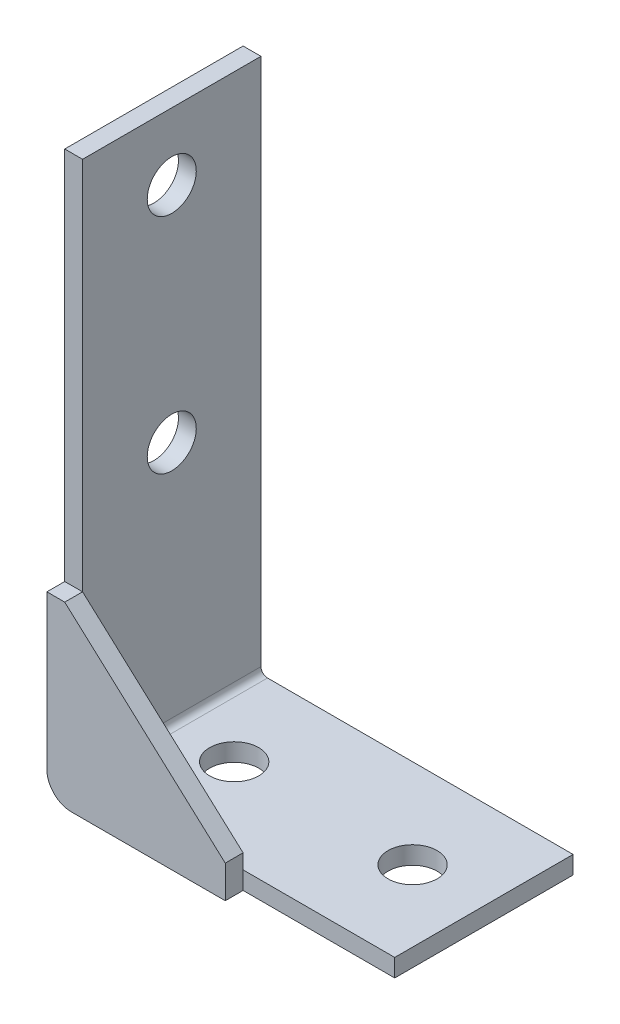
ISO-10303-21;
HEADER;
FILE_DESCRIPTION(('STEP AP214'),'2;1');
FILE_NAME('part.step','',(''),(''),'','','');
FILE_SCHEMA(('AUTOMOTIVE_DESIGN { 1 0 10303 214 1 1 1 1 }'));
ENDSEC;
DATA;
#1=APPLICATION_CONTEXT('core data for automotive mechanical design processes');
#2=APPLICATION_PROTOCOL_DEFINITION('international standard','automotive_design',2000,#1);
#3=PRODUCT_CONTEXT('',#1,'mechanical');
#4=PRODUCT('Part','Part','',(#3));
#5=PRODUCT_RELATED_PRODUCT_CATEGORY('part','',(#4));
#6=PRODUCT_DEFINITION_FORMATION('','',#4);
#7=PRODUCT_DEFINITION_CONTEXT('part definition',#1,'design');
#8=PRODUCT_DEFINITION('design','',#6,#7);
#9=PRODUCT_DEFINITION_SHAPE('','',#8);
#10=(LENGTH_UNIT() NAMED_UNIT(*) SI_UNIT(.MILLI.,.METRE.));
#11=(NAMED_UNIT(*) PLANE_ANGLE_UNIT() SI_UNIT($,.RADIAN.));
#12=(NAMED_UNIT(*) SI_UNIT($,.STERADIAN.) SOLID_ANGLE_UNIT());
#13=UNCERTAINTY_MEASURE_WITH_UNIT(LENGTH_MEASURE(1.E-05),#10,'distance_accuracy_value','');
#14=(GEOMETRIC_REPRESENTATION_CONTEXT(3) GLOBAL_UNCERTAINTY_ASSIGNED_CONTEXT((#13)) GLOBAL_UNIT_ASSIGNED_CONTEXT((#10,
#11,#12)) REPRESENTATION_CONTEXT('',''));
#15=CARTESIAN_POINT('',(0.,0.,0.));
#16=DIRECTION('',(0.,0.,1.));
#17=DIRECTION('',(1.,0.,0.));
#18=AXIS2_PLACEMENT_3D('',#15,#16,#17);
#19=CARTESIAN_POINT('',(0.736599999999993,-2.,12.));
#20=DIRECTION('',(0.,1.,0.));
#21=DIRECTION('',(0.,0.,1.));
#22=AXIS2_PLACEMENT_3D('',#19,#20,#21);
#23=PLANE('',#22);
#24=DIRECTION('',(1.,0.,0.));
#25=VECTOR('',#24,1.);
#26=CARTESIAN_POINT('',(0.736599999999993,-2.,10.));
#27=LINE('',#26,#25);
#28=CARTESIAN_POINT('',(0.736599999999993,-2.,10.));
#29=VERTEX_POINT('',#28);
#30=CARTESIAN_POINT('',(18.,-2.,10.));
#31=VERTEX_POINT('',#30);
#32=EDGE_CURVE('E135',#29,#31,#27,.T.);
#33=ORIENTED_EDGE('',*,*,#32,.T.);
#34=DIRECTION('',(0.,0.,-1.));
#35=VECTOR('',#34,1.);
#36=CARTESIAN_POINT('',(18.,-2.,12.));
#37=LINE('',#36,#35);
#38=CARTESIAN_POINT('',(18.,-2.,12.));
#39=VERTEX_POINT('',#38);
#40=EDGE_CURVE('E12',#39,#31,#37,.T.);
#41=ORIENTED_EDGE('',*,*,#40,.F.);
#42=DIRECTION('',(1.,0.,0.));
#43=VECTOR('',#42,1.);
#44=CARTESIAN_POINT('',(0.736599999999993,-2.,12.));
#45=LINE('',#44,#43);
#46=CARTESIAN_POINT('',(0.736599999999993,-2.,12.));
#47=VERTEX_POINT('',#46);
#48=EDGE_CURVE('E145',#47,#39,#45,.T.);
#49=ORIENTED_EDGE('',*,*,#48,.F.);
#50=DIRECTION('',(0.,0.,-1.));
#51=VECTOR('',#50,1.);
#52=CARTESIAN_POINT('',(0.736599999999993,-2.,12.));
#53=LINE('',#52,#51);
#54=EDGE_CURVE('E131',#47,#29,#53,.T.);
#55=ORIENTED_EDGE('',*,*,#54,.T.);
#56=EDGE_LOOP('',(#33,#41,#49,#55));
#57=FACE_BOUND('',#56,.T.);
#58=ADVANCED_FACE('F51',(#57),#23,.F.);
#59=CARTESIAN_POINT('',(18.,-2.,12.));
#60=DIRECTION('',(-1.,0.,0.));
#61=DIRECTION('',(0.,0.,1.));
#62=AXIS2_PLACEMENT_3D('',#59,#60,#61);
#63=PLANE('',#62);
#64=DIRECTION('',(0.,1.,0.));
#65=VECTOR('',#64,1.);
#66=CARTESIAN_POINT('',(18.,-2.,10.));
#67=LINE('',#66,#65);
#68=CARTESIAN_POINT('',(18.,1.65638944791499,10.));
#69=VERTEX_POINT('',#68);
#70=EDGE_CURVE('E138',#31,#69,#67,.T.);
#71=ORIENTED_EDGE('',*,*,#70,.T.);
#72=DIRECTION('',(0.,0.,-1.));
#73=VECTOR('',#72,1.);
#74=CARTESIAN_POINT('',(18.,1.65638944791499,12.));
#75=LINE('',#74,#73);
#76=CARTESIAN_POINT('',(18.,1.65638944791499,12.));
#77=VERTEX_POINT('',#76);
#78=EDGE_CURVE('E59',#77,#69,#75,.T.);
#79=ORIENTED_EDGE('',*,*,#78,.F.);
#80=DIRECTION('',(0.,1.,0.));
#81=VECTOR('',#80,1.);
#82=CARTESIAN_POINT('',(18.,-2.,12.));
#83=LINE('',#82,#81);
#84=EDGE_CURVE('E104',#39,#77,#83,.T.);
#85=ORIENTED_EDGE('',*,*,#84,.F.);
#86=ORIENTED_EDGE('',*,*,#40,.T.);
#87=EDGE_LOOP('',(#71,#79,#85,#86));
#88=FACE_BOUND('',#87,.T.);
#89=ADVANCED_FACE('F169',(#88),#63,.F.);
#90=CARTESIAN_POINT('',(18.,1.65638944791499,12.));
#91=DIRECTION('',(-0.67222169896844,-0.740349908783667,0.));
#92=DIRECTION('',(0.740349908783667,-0.67222169896844,0.));
#93=AXIS2_PLACEMENT_3D('',#90,#91,#92);
#94=PLANE('',#93);
#95=DIRECTION('',(-0.740349908783667,0.67222169896844,0.));
#96=VECTOR('',#95,1.);
#97=CARTESIAN_POINT('',(18.,1.65638944791499,10.));
#98=LINE('',#97,#96);
#99=CARTESIAN_POINT('',(0.,18.,10.));
#100=VERTEX_POINT('',#99);
#101=EDGE_CURVE('E140',#69,#100,#98,.T.);
#102=ORIENTED_EDGE('',*,*,#101,.T.);
#103=DIRECTION('',(0.,0.,-1.));
#104=VECTOR('',#103,1.);
#105=CARTESIAN_POINT('',(0.,18.,12.));
#106=LINE('',#105,#104);
#107=CARTESIAN_POINT('',(0.,18.,12.));
#108=VERTEX_POINT('',#107);
#109=EDGE_CURVE('E126',#108,#100,#106,.T.);
#110=ORIENTED_EDGE('',*,*,#109,.F.);
#111=DIRECTION('',(-0.740349908783667,0.67222169896844,0.));
#112=VECTOR('',#111,1.);
#113=CARTESIAN_POINT('',(18.,1.65638944791499,12.));
#114=LINE('',#113,#112);
#115=EDGE_CURVE('E117',#77,#108,#114,.T.);
#116=ORIENTED_EDGE('',*,*,#115,.F.);
#117=ORIENTED_EDGE('',*,*,#78,.T.);
#118=EDGE_LOOP('',(#102,#110,#116,#117));
#119=FACE_BOUND('',#118,.T.);
#120=ADVANCED_FACE('F151',(#119),#94,.F.);
#121=CARTESIAN_POINT('',(0.,18.,12.));
#122=DIRECTION('',(0.,-1.,0.));
#123=DIRECTION('',(0.,0.,-1.));
#124=AXIS2_PLACEMENT_3D('',#121,#122,#123);
#125=PLANE('',#124);
#126=DIRECTION('',(-1.,0.,0.));
#127=VECTOR('',#126,1.);
#128=CARTESIAN_POINT('',(0.,18.,10.));
#129=LINE('',#128,#127);
#130=CARTESIAN_POINT('',(-2.,18.,10.));
#131=VERTEX_POINT('',#130);
#132=EDGE_CURVE('E125',#100,#131,#129,.T.);
#133=ORIENTED_EDGE('',*,*,#132,.T.);
#134=DIRECTION('',(0.,0.,-1.));
#135=VECTOR('',#134,1.);
#136=CARTESIAN_POINT('',(-2.,18.,12.));
#137=LINE('',#136,#135);
#138=CARTESIAN_POINT('',(-2.,18.,12.));
#139=VERTEX_POINT('',#138);
#140=EDGE_CURVE('E122',#139,#131,#137,.T.);
#141=ORIENTED_EDGE('',*,*,#140,.F.);
#142=DIRECTION('',(-1.,0.,0.));
#143=VECTOR('',#142,1.);
#144=CARTESIAN_POINT('',(0.,18.,12.));
#145=LINE('',#144,#143);
#146=EDGE_CURVE('E111',#108,#139,#145,.T.);
#147=ORIENTED_EDGE('',*,*,#146,.F.);
#148=ORIENTED_EDGE('',*,*,#109,.T.);
#149=EDGE_LOOP('',(#133,#141,#147,#148));
#150=FACE_BOUND('',#149,.T.);
#151=ADVANCED_FACE('F123',(#150),#125,.F.);
#152=CARTESIAN_POINT('',(-2.,18.,12.));
#153=DIRECTION('',(1.,0.,0.));
#154=DIRECTION('',(0.,1.,0.));
#155=AXIS2_PLACEMENT_3D('',#152,#153,#154);
#156=PLANE('',#155);
#157=DIRECTION('',(0.,-1.,0.));
#158=VECTOR('',#157,1.);
#159=CARTESIAN_POINT('',(-2.,18.,10.));
#160=LINE('',#159,#158);
#161=CARTESIAN_POINT('',(-2.,0.736599999999994,10.));
#162=VERTEX_POINT('',#161);
#163=EDGE_CURVE('E90',#131,#162,#160,.T.);
#164=ORIENTED_EDGE('',*,*,#163,.T.);
#165=DIRECTION('',(0.,0.,-1.));
#166=VECTOR('',#165,1.);
#167=CARTESIAN_POINT('',(-2.,0.736599999999994,12.));
#168=LINE('',#167,#166);
#169=CARTESIAN_POINT('',(-2.,0.736599999999994,12.));
#170=VERTEX_POINT('',#169);
#171=EDGE_CURVE('E127',#170,#162,#168,.T.);
#172=ORIENTED_EDGE('',*,*,#171,.F.);
#173=DIRECTION('',(0.,-1.,0.));
#174=VECTOR('',#173,1.);
#175=CARTESIAN_POINT('',(-2.,18.,12.));
#176=LINE('',#175,#174);
#177=EDGE_CURVE('E115',#139,#170,#176,.T.);
#178=ORIENTED_EDGE('',*,*,#177,.F.);
#179=ORIENTED_EDGE('',*,*,#140,.T.);
#180=EDGE_LOOP('',(#164,#172,#178,#179));
#181=FACE_BOUND('',#180,.T.);
#182=ADVANCED_FACE('F129',(#181),#156,.F.);
#183=CARTESIAN_POINT('',(0.736599999999994,0.736599999999994,12.));
#184=DIRECTION('',(0.,0.,-1.));
#185=DIRECTION('',(-1.,0.,0.));
#186=AXIS2_PLACEMENT_3D('',#183,#184,#185);
#187=CYLINDRICAL_SURFACE('',#186,2.73659999999999);
#188=CARTESIAN_POINT('',(0.736599999999994,0.736599999999994,10.));
#189=DIRECTION('',(0.,0.,1.));
#190=DIRECTION('',(1.,0.,0.));
#191=AXIS2_PLACEMENT_3D('',#188,#189,#190);
#192=CIRCLE('',#191,2.73659999999999);
#193=EDGE_CURVE('E96',#162,#29,#192,.T.);
#194=ORIENTED_EDGE('',*,*,#193,.T.);
#195=ORIENTED_EDGE('',*,*,#54,.F.);
#196=CARTESIAN_POINT('',(0.736599999999994,0.736599999999994,12.));
#197=DIRECTION('',(0.,0.,1.));
#198=DIRECTION('',(1.,0.,0.));
#199=AXIS2_PLACEMENT_3D('',#196,#197,#198);
#200=CIRCLE('',#199,2.73659999999999);
#201=EDGE_CURVE('E67',#170,#47,#200,.T.);
#202=ORIENTED_EDGE('',*,*,#201,.F.);
#203=ORIENTED_EDGE('',*,*,#171,.T.);
#204=EDGE_LOOP('',(#194,#195,#202,#203));
#205=FACE_BOUND('',#204,.T.);
#206=ADVANCED_FACE('F158',(#205),#187,.T.);
#207=CARTESIAN_POINT('',(0.736599999999994,0.736599999999994,12.));
#208=DIRECTION('',(0.,0.,1.));
#209=DIRECTION('',(1.,0.,0.));
#210=AXIS2_PLACEMENT_3D('',#207,#208,#209);
#211=PLANE('',#210);
#212=ORIENTED_EDGE('',*,*,#48,.T.);
#213=ORIENTED_EDGE('',*,*,#84,.T.);
#214=ORIENTED_EDGE('',*,*,#115,.T.);
#215=ORIENTED_EDGE('',*,*,#146,.T.);
#216=ORIENTED_EDGE('',*,*,#177,.T.);
#217=ORIENTED_EDGE('',*,*,#201,.T.);
#218=EDGE_LOOP('',(#212,#213,#214,#215,#216,#217));
#219=FACE_BOUND('',#218,.T.);
#220=ADVANCED_FACE('F113',(#219),#211,.T.);
#221=CARTESIAN_POINT('',(0.736599999999994,0.736599999999994,10.));
#222=DIRECTION('',(0.,0.,1.));
#223=DIRECTION('',(1.,0.,0.));
#224=AXIS2_PLACEMENT_3D('',#221,#222,#223);
#225=PLANE('',#224);
#226=ORIENTED_EDGE('',*,*,#32,.F.);
#227=ORIENTED_EDGE('',*,*,#193,.F.);
#228=ORIENTED_EDGE('',*,*,#163,.F.);
#229=ORIENTED_EDGE('',*,*,#132,.F.);
#230=ORIENTED_EDGE('',*,*,#101,.F.);
#231=ORIENTED_EDGE('',*,*,#70,.F.);
#232=EDGE_LOOP('',(#226,#227,#228,#229,#230,#231));
#233=FACE_BOUND('',#232,.T.);
#234=ADVANCED_FACE('F154',(#233),#225,.F.);
#235=CLOSED_SHELL('',(#58,#89,#120,#151,#182,#206,#220,#234));
#236=MANIFOLD_SOLID_BREP('B2',#235);
#237=CARTESIAN_POINT('',(0.7366,0.,10.));
#238=DIRECTION('',(0.,0.,1.));
#239=DIRECTION('',(1.,0.,0.));
#240=AXIS2_PLACEMENT_3D('',#237,#238,#239);
#241=PLANE('',#240);
#242=DIRECTION('',(0.,-1.,0.));
#243=VECTOR('',#242,1.);
#244=CARTESIAN_POINT('',(0.7366,0.,10.));
#245=LINE('',#244,#243);
#246=CARTESIAN_POINT('',(0.7366,0.,10.));
#247=VERTEX_POINT('',#246);
#248=CARTESIAN_POINT('',(0.7366,-2.,10.));
#249=VERTEX_POINT('',#248);
#250=EDGE_CURVE('E49',#247,#249,#245,.T.);
#251=ORIENTED_EDGE('',*,*,#250,.F.);
#252=CARTESIAN_POINT('',(0.7366,0.736599999999998,10.));
#253=DIRECTION('',(0.,0.,-1.));
#254=DIRECTION('',(-1.,0.,0.));
#255=AXIS2_PLACEMENT_3D('',#252,#253,#254);
#256=CIRCLE('',#255,0.7366);
#257=CARTESIAN_POINT('',(0.,0.736599999999997,10.));
#258=VERTEX_POINT('',#257);
#259=EDGE_CURVE('E340',#258,#247,#256,.F.);
#260=ORIENTED_EDGE('',*,*,#259,.F.);
#261=DIRECTION('',(1.,0.,0.));
#262=VECTOR('',#261,1.);
#263=CARTESIAN_POINT('',(-2.,0.736599999999994,10.));
#264=LINE('',#263,#262);
#265=CARTESIAN_POINT('',(-2.,0.736599999999994,10.));
#266=VERTEX_POINT('',#265);
#267=EDGE_CURVE('E251',#266,#258,#264,.T.);
#268=ORIENTED_EDGE('',*,*,#267,.F.);
#269=CARTESIAN_POINT('',(0.7366,0.736599999999998,10.));
#270=DIRECTION('',(0.,0.,1.));
#271=DIRECTION('',(1.,0.,0.));
#272=AXIS2_PLACEMENT_3D('',#269,#270,#271);
#273=CIRCLE('',#272,2.7366);
#274=EDGE_CURVE('E333',#266,#249,#273,.T.);
#275=ORIENTED_EDGE('',*,*,#274,.T.);
#276=EDGE_LOOP('',(#251,#260,#268,#275));
#277=FACE_BOUND('',#276,.T.);
#278=ADVANCED_FACE('F243',(#277),#241,.T.);
#279=CARTESIAN_POINT('',(-2.,0.736599999999994,10.));
#280=DIRECTION('',(0.,0.,1.));
#281=DIRECTION('',(1.,0.,0.));
#282=AXIS2_PLACEMENT_3D('',#279,#280,#281);
#283=PLANE('',#282);
#284=DIRECTION('',(1.,0.,0.));
#285=VECTOR('',#284,1.);
#286=CARTESIAN_POINT('',(0.,0.,10.));
#287=LINE('',#286,#285);
#288=CARTESIAN_POINT('',(35.,0.,10.));
#289=VERTEX_POINT('',#288);
#290=EDGE_CURVE('E390',#247,#289,#287,.T.);
#291=ORIENTED_EDGE('',*,*,#290,.F.);
#292=ORIENTED_EDGE('',*,*,#250,.T.);
#293=DIRECTION('',(1.,0.,0.));
#294=VECTOR('',#293,1.);
#295=CARTESIAN_POINT('',(0.,-2.,10.));
#296=LINE('',#295,#294);
#297=CARTESIAN_POINT('',(35.,-2.,10.));
#298=VERTEX_POINT('',#297);
#299=EDGE_CURVE('E299',#249,#298,#296,.T.);
#300=ORIENTED_EDGE('',*,*,#299,.T.);
#301=DIRECTION('',(0.,-1.,0.));
#302=VECTOR('',#301,1.);
#303=CARTESIAN_POINT('',(35.,0.,10.));
#304=LINE('',#303,#302);
#305=EDGE_CURVE('E597',#289,#298,#304,.T.);
#306=ORIENTED_EDGE('',*,*,#305,.F.);
#307=EDGE_LOOP('',(#291,#292,#300,#306));
#308=FACE_BOUND('',#307,.T.);
#309=ADVANCED_FACE('F398',(#308),#283,.T.);
#310=CARTESIAN_POINT('',(0.,0.736599999999997,-10.));
#311=DIRECTION('',(0.,0.,-1.));
#312=DIRECTION('',(-1.,0.,0.));
#313=AXIS2_PLACEMENT_3D('',#310,#311,#312);
#314=PLANE('',#313);
#315=DIRECTION('',(-1.,0.,0.));
#316=VECTOR('',#315,1.);
#317=CARTESIAN_POINT('',(0.,0.736599999999997,-10.));
#318=LINE('',#317,#316);
#319=CARTESIAN_POINT('',(0.,0.736599999999997,-10.));
#320=VERTEX_POINT('',#319);
#321=CARTESIAN_POINT('',(-2.,0.736599999999994,-10.));
#322=VERTEX_POINT('',#321);
#323=EDGE_CURVE('E286',#320,#322,#318,.T.);
#324=ORIENTED_EDGE('',*,*,#323,.F.);
#325=CARTESIAN_POINT('',(0.7366,0.736599999999998,-10.));
#326=DIRECTION('',(0.,0.,-1.));
#327=DIRECTION('',(-1.,0.,0.));
#328=AXIS2_PLACEMENT_3D('',#325,#326,#327);
#329=CIRCLE('',#328,0.7366);
#330=CARTESIAN_POINT('',(0.7366,0.,-10.));
#331=VERTEX_POINT('',#330);
#332=EDGE_CURVE('E356',#320,#331,#329,.F.);
#333=ORIENTED_EDGE('',*,*,#332,.T.);
#334=DIRECTION('',(0.,1.,0.));
#335=VECTOR('',#334,1.);
#336=CARTESIAN_POINT('',(0.7366,-2.,-10.));
#337=LINE('',#336,#335);
#338=CARTESIAN_POINT('',(0.7366,-2.,-10.));
#339=VERTEX_POINT('',#338);
#340=EDGE_CURVE('E293',#339,#331,#337,.T.);
#341=ORIENTED_EDGE('',*,*,#340,.F.);
#342=CARTESIAN_POINT('',(0.7366,0.736599999999998,-10.));
#343=DIRECTION('',(0.,0.,1.));
#344=DIRECTION('',(1.,0.,0.));
#345=AXIS2_PLACEMENT_3D('',#342,#343,#344);
#346=CIRCLE('',#345,2.7366);
#347=EDGE_CURVE('E363',#322,#339,#346,.T.);
#348=ORIENTED_EDGE('',*,*,#347,.F.);
#349=EDGE_LOOP('',(#324,#333,#341,#348));
#350=FACE_BOUND('',#349,.T.);
#351=ADVANCED_FACE('F396',(#350),#314,.T.);
#352=CARTESIAN_POINT('',(0.7366,-2.,-10.));
#353=DIRECTION('',(0.,0.,-1.));
#354=DIRECTION('',(-1.,0.,0.));
#355=AXIS2_PLACEMENT_3D('',#352,#353,#354);
#356=PLANE('',#355);
#357=DIRECTION('',(0.,-1.,0.));
#358=VECTOR('',#357,1.);
#359=CARTESIAN_POINT('',(0.,60.,-10.));
#360=LINE('',#359,#358);
#361=CARTESIAN_POINT('',(0.,60.,-10.));
#362=VERTEX_POINT('',#361);
#363=EDGE_CURVE('E358',#362,#320,#360,.T.);
#364=ORIENTED_EDGE('',*,*,#363,.T.);
#365=ORIENTED_EDGE('',*,*,#323,.T.);
#366=DIRECTION('',(0.,-1.,0.));
#367=VECTOR('',#366,1.);
#368=CARTESIAN_POINT('',(-2.,60.,-10.));
#369=LINE('',#368,#367);
#370=CARTESIAN_POINT('',(-2.,60.,-10.));
#371=VERTEX_POINT('',#370);
#372=EDGE_CURVE('E361',#371,#322,#369,.T.);
#373=ORIENTED_EDGE('',*,*,#372,.F.);
#374=DIRECTION('',(1.,0.,0.));
#375=VECTOR('',#374,1.);
#376=CARTESIAN_POINT('',(-2.,60.,-10.));
#377=LINE('',#376,#375);
#378=EDGE_CURVE('E321',#371,#362,#377,.T.);
#379=ORIENTED_EDGE('',*,*,#378,.T.);
#380=EDGE_LOOP('',(#364,#365,#373,#379));
#381=FACE_BOUND('',#380,.T.);
#382=ADVANCED_FACE('F392',(#381),#356,.T.);
#383=CARTESIAN_POINT('',(0.,-2.,10.));
#384=DIRECTION('',(0.,1.,0.));
#385=DIRECTION('',(0.,0.,1.));
#386=AXIS2_PLACEMENT_3D('',#383,#384,#385);
#387=PLANE('',#386);
#388=CARTESIAN_POINT('',(7.,-2.,0.));
#389=DIRECTION('',(0.,1.,0.));
#390=DIRECTION('',(0.,0.,1.));
#391=AXIS2_PLACEMENT_3D('',#388,#389,#390);
#392=CIRCLE('',#391,2.75);
#393=CARTESIAN_POINT('',(7.,-2.,2.75));
#394=VERTEX_POINT('',#393);
#395=EDGE_CURVE('E588',#394,#394,#392,.T.);
#396=ORIENTED_EDGE('',*,*,#395,.T.);
#397=EDGE_LOOP('',(#396));
#398=FACE_BOUND('',#397,.T.);
#399=CARTESIAN_POINT('',(27.,-2.,0.));
#400=DIRECTION('',(0.,1.,0.));
#401=DIRECTION('',(0.,0.,1.));
#402=AXIS2_PLACEMENT_3D('',#399,#400,#401);
#403=CIRCLE('',#402,2.75);
#404=CARTESIAN_POINT('',(27.,-2.,2.75));
#405=VERTEX_POINT('',#404);
#406=EDGE_CURVE('E350',#405,#405,#403,.T.);
#407=ORIENTED_EDGE('',*,*,#406,.T.);
#408=EDGE_LOOP('',(#407));
#409=FACE_BOUND('',#408,.T.);
#410=DIRECTION('',(1.,0.,0.));
#411=VECTOR('',#410,1.);
#412=CARTESIAN_POINT('',(0.,-2.,-10.));
#413=LINE('',#412,#411);
#414=CARTESIAN_POINT('',(35.,-2.,-10.));
#415=VERTEX_POINT('',#414);
#416=EDGE_CURVE('E346',#339,#415,#413,.T.);
#417=ORIENTED_EDGE('',*,*,#416,.T.);
#418=DIRECTION('',(0.,0.,-1.));
#419=VECTOR('',#418,1.);
#420=CARTESIAN_POINT('',(35.,-2.,10.));
#421=LINE('',#420,#419);
#422=EDGE_CURVE('E377',#298,#415,#421,.T.);
#423=ORIENTED_EDGE('',*,*,#422,.F.);
#424=ORIENTED_EDGE('',*,*,#299,.F.);
#425=DIRECTION('',(0.,0.,-1.));
#426=VECTOR('',#425,1.);
#427=CARTESIAN_POINT('',(0.7366,-2.,10.));
#428=LINE('',#427,#426);
#429=EDGE_CURVE('E345',#249,#339,#428,.T.);
#430=ORIENTED_EDGE('',*,*,#429,.T.);
#431=EDGE_LOOP('',(#417,#423,#424,#430));
#432=FACE_BOUND('',#431,.T.);
#433=ADVANCED_FACE('F404',(#398,#409,#432),#387,.F.);
#434=CARTESIAN_POINT('',(35.,0.,10.));
#435=DIRECTION('',(1.,0.,0.));
#436=DIRECTION('',(0.,0.,-1.));
#437=AXIS2_PLACEMENT_3D('',#434,#435,#436);
#438=PLANE('',#437);
#439=DIRECTION('',(0.,-1.,0.));
#440=VECTOR('',#439,1.);
#441=CARTESIAN_POINT('',(35.,0.,-10.));
#442=LINE('',#441,#440);
#443=CARTESIAN_POINT('',(35.,0.,-10.));
#444=VERTEX_POINT('',#443);
#445=EDGE_CURVE('E349',#444,#415,#442,.T.);
#446=ORIENTED_EDGE('',*,*,#445,.F.);
#447=DIRECTION('',(0.,0.,-1.));
#448=VECTOR('',#447,1.);
#449=CARTESIAN_POINT('',(35.,0.,10.));
#450=LINE('',#449,#448);
#451=EDGE_CURVE('E375',#289,#444,#450,.T.);
#452=ORIENTED_EDGE('',*,*,#451,.F.);
#453=ORIENTED_EDGE('',*,*,#305,.T.);
#454=ORIENTED_EDGE('',*,*,#422,.T.);
#455=EDGE_LOOP('',(#446,#452,#453,#454));
#456=FACE_BOUND('',#455,.T.);
#457=ADVANCED_FACE('F433',(#456),#438,.T.);
#458=CARTESIAN_POINT('',(0.,0.,10.));
#459=DIRECTION('',(0.,1.,0.));
#460=DIRECTION('',(0.,0.,1.));
#461=AXIS2_PLACEMENT_3D('',#458,#459,#460);
#462=PLANE('',#461);
#463=CARTESIAN_POINT('',(7.,0.,0.));
#464=DIRECTION('',(0.,1.,0.));
#465=DIRECTION('',(0.,0.,1.));
#466=AXIS2_PLACEMENT_3D('',#463,#464,#465);
#467=CIRCLE('',#466,2.75);
#468=CARTESIAN_POINT('',(7.,0.,2.75));
#469=VERTEX_POINT('',#468);
#470=EDGE_CURVE('E585',#469,#469,#467,.T.);
#471=ORIENTED_EDGE('',*,*,#470,.F.);
#472=EDGE_LOOP('',(#471));
#473=FACE_BOUND('',#472,.T.);
#474=CARTESIAN_POINT('',(27.,0.,0.));
#475=DIRECTION('',(0.,1.,0.));
#476=DIRECTION('',(0.,0.,1.));
#477=AXIS2_PLACEMENT_3D('',#474,#475,#476);
#478=CIRCLE('',#477,2.75);
#479=CARTESIAN_POINT('',(27.,0.,2.75));
#480=VERTEX_POINT('',#479);
#481=EDGE_CURVE('E591',#480,#480,#478,.T.);
#482=ORIENTED_EDGE('',*,*,#481,.F.);
#483=EDGE_LOOP('',(#482));
#484=FACE_BOUND('',#483,.T.);
#485=DIRECTION('',(1.,0.,0.));
#486=VECTOR('',#485,1.);
#487=CARTESIAN_POINT('',(0.,0.,-10.));
#488=LINE('',#487,#486);
#489=EDGE_CURVE('E353',#331,#444,#488,.T.);
#490=ORIENTED_EDGE('',*,*,#489,.F.);
#491=DIRECTION('',(0.,0.,-1.));
#492=VECTOR('',#491,1.);
#493=CARTESIAN_POINT('',(0.7366,0.,10.));
#494=LINE('',#493,#492);
#495=EDGE_CURVE('E372',#247,#331,#494,.T.);
#496=ORIENTED_EDGE('',*,*,#495,.F.);
#497=ORIENTED_EDGE('',*,*,#290,.T.);
#498=ORIENTED_EDGE('',*,*,#451,.T.);
#499=EDGE_LOOP('',(#490,#496,#497,#498));
#500=FACE_BOUND('',#499,.T.);
#501=ADVANCED_FACE('F438',(#473,#484,#500),#462,.T.);
#502=CARTESIAN_POINT('',(0.7366,0.736599999999998,10.));
#503=DIRECTION('',(0.,0.,-1.));
#504=DIRECTION('',(-1.,0.,0.));
#505=AXIS2_PLACEMENT_3D('',#502,#503,#504);
#506=CYLINDRICAL_SURFACE('',#505,0.7366);
#507=ORIENTED_EDGE('',*,*,#332,.F.);
#508=DIRECTION('',(0.,0.,-1.));
#509=VECTOR('',#508,1.);
#510=CARTESIAN_POINT('',(0.,0.736599999999997,10.));
#511=LINE('',#510,#509);
#512=EDGE_CURVE('E369',#258,#320,#511,.T.);
#513=ORIENTED_EDGE('',*,*,#512,.F.);
#514=ORIENTED_EDGE('',*,*,#259,.T.);
#515=ORIENTED_EDGE('',*,*,#495,.T.);
#516=EDGE_LOOP('',(#507,#513,#514,#515));
#517=FACE_BOUND('',#516,.T.);
#518=ADVANCED_FACE('F386',(#517),#506,.F.);
#519=CARTESIAN_POINT('',(0.,60.,10.));
#520=DIRECTION('',(1.,0.,0.));
#521=DIRECTION('',(0.,1.,0.));
#522=AXIS2_PLACEMENT_3D('',#519,#520,#521);
#523=PLANE('',#522);
#524=CARTESIAN_POINT('',(0.,52.5,0.));
#525=DIRECTION('',(1.,0.,0.));
#526=DIRECTION('',(0.,1.,0.));
#527=AXIS2_PLACEMENT_3D('',#524,#525,#526);
#528=CIRCLE('',#527,2.74999999999999);
#529=CARTESIAN_POINT('',(0.,55.25,0.));
#530=VERTEX_POINT('',#529);
#531=EDGE_CURVE('E572',#530,#530,#528,.T.);
#532=ORIENTED_EDGE('',*,*,#531,.F.);
#533=EDGE_LOOP('',(#532));
#534=FACE_BOUND('',#533,.T.);
#535=CARTESIAN_POINT('',(0.,27.5,0.));
#536=DIRECTION('',(1.,0.,0.));
#537=DIRECTION('',(0.,1.,0.));
#538=AXIS2_PLACEMENT_3D('',#535,#536,#537);
#539=CIRCLE('',#538,2.74999999999999);
#540=CARTESIAN_POINT('',(0.,30.25,0.));
#541=VERTEX_POINT('',#540);
#542=EDGE_CURVE('E582',#541,#541,#539,.T.);
#543=ORIENTED_EDGE('',*,*,#542,.F.);
#544=EDGE_LOOP('',(#543));
#545=FACE_BOUND('',#544,.T.);
#546=ORIENTED_EDGE('',*,*,#363,.F.);
#547=DIRECTION('',(0.,0.,-1.));
#548=VECTOR('',#547,1.);
#549=CARTESIAN_POINT('',(0.,60.,10.));
#550=LINE('',#549,#548);
#551=CARTESIAN_POINT('',(0.,60.,10.));
#552=VERTEX_POINT('',#551);
#553=EDGE_CURVE('E323',#552,#362,#550,.T.);
#554=ORIENTED_EDGE('',*,*,#553,.F.);
#555=DIRECTION('',(0.,-1.,0.));
#556=VECTOR('',#555,1.);
#557=CARTESIAN_POINT('',(0.,60.,10.));
#558=LINE('',#557,#556);
#559=EDGE_CURVE('E338',#552,#258,#558,.T.);
#560=ORIENTED_EDGE('',*,*,#559,.T.);
#561=ORIENTED_EDGE('',*,*,#512,.T.);
#562=EDGE_LOOP('',(#546,#554,#560,#561));
#563=FACE_BOUND('',#562,.T.);
#564=ADVANCED_FACE('F391',(#534,#545,#563),#523,.T.);
#565=CARTESIAN_POINT('',(-2.,60.,10.));
#566=DIRECTION('',(0.,1.,0.));
#567=DIRECTION('',(0.,0.,1.));
#568=AXIS2_PLACEMENT_3D('',#565,#566,#567);
#569=PLANE('',#568);
#570=ORIENTED_EDGE('',*,*,#378,.F.);
#571=DIRECTION('',(0.,0.,-1.));
#572=VECTOR('',#571,1.);
#573=CARTESIAN_POINT('',(-2.,60.,10.));
#574=LINE('',#573,#572);
#575=CARTESIAN_POINT('',(-2.,60.,10.));
#576=VERTEX_POINT('',#575);
#577=EDGE_CURVE('E315',#576,#371,#574,.T.);
#578=ORIENTED_EDGE('',*,*,#577,.F.);
#579=DIRECTION('',(1.,0.,0.));
#580=VECTOR('',#579,1.);
#581=CARTESIAN_POINT('',(-2.,60.,10.));
#582=LINE('',#581,#580);
#583=EDGE_CURVE('E319',#576,#552,#582,.T.);
#584=ORIENTED_EDGE('',*,*,#583,.T.);
#585=ORIENTED_EDGE('',*,*,#553,.T.);
#586=EDGE_LOOP('',(#570,#578,#584,#585));
#587=FACE_BOUND('',#586,.T.);
#588=ADVANCED_FACE('F317',(#587),#569,.T.);
#589=CARTESIAN_POINT('',(-2.,60.,10.));
#590=DIRECTION('',(1.,0.,0.));
#591=DIRECTION('',(0.,1.,0.));
#592=AXIS2_PLACEMENT_3D('',#589,#590,#591);
#593=PLANE('',#592);
#594=CARTESIAN_POINT('',(-2.,52.5,0.));
#595=DIRECTION('',(-1.,0.,0.));
#596=DIRECTION('',(0.,0.,1.));
#597=AXIS2_PLACEMENT_3D('',#594,#595,#596);
#598=CIRCLE('',#597,2.74999999999999);
#599=CARTESIAN_POINT('',(-2.,52.5,2.74999999999999));
#600=VERTEX_POINT('',#599);
#601=EDGE_CURVE('E575',#600,#600,#598,.T.);
#602=ORIENTED_EDGE('',*,*,#601,.F.);
#603=EDGE_LOOP('',(#602));
#604=FACE_BOUND('',#603,.T.);
#605=CARTESIAN_POINT('',(-2.,27.5,0.));
#606=DIRECTION('',(-1.,0.,0.));
#607=DIRECTION('',(0.,0.,1.));
#608=AXIS2_PLACEMENT_3D('',#605,#606,#607);
#609=CIRCLE('',#608,2.74999999999999);
#610=CARTESIAN_POINT('',(-2.,27.5,2.74999999999999));
#611=VERTEX_POINT('',#610);
#612=EDGE_CURVE('E577',#611,#611,#609,.T.);
#613=ORIENTED_EDGE('',*,*,#612,.F.);
#614=EDGE_LOOP('',(#613));
#615=FACE_BOUND('',#614,.T.);
#616=ORIENTED_EDGE('',*,*,#372,.T.);
#617=DIRECTION('',(0.,0.,-1.));
#618=VECTOR('',#617,1.);
#619=CARTESIAN_POINT('',(-2.,0.736599999999994,10.));
#620=LINE('',#619,#618);
#621=EDGE_CURVE('E324',#266,#322,#620,.T.);
#622=ORIENTED_EDGE('',*,*,#621,.F.);
#623=DIRECTION('',(0.,-1.,0.));
#624=VECTOR('',#623,1.);
#625=CARTESIAN_POINT('',(-2.,60.,10.));
#626=LINE('',#625,#624);
#627=EDGE_CURVE('E328',#576,#266,#626,.T.);
#628=ORIENTED_EDGE('',*,*,#627,.F.);
#629=ORIENTED_EDGE('',*,*,#577,.T.);
#630=EDGE_LOOP('',(#616,#622,#628,#629));
#631=FACE_BOUND('',#630,.T.);
#632=ADVANCED_FACE('F329',(#604,#615,#631),#593,.F.);
#633=CARTESIAN_POINT('',(0.7366,0.736599999999998,10.));
#634=DIRECTION('',(0.,0.,-1.));
#635=DIRECTION('',(-1.,0.,0.));
#636=AXIS2_PLACEMENT_3D('',#633,#634,#635);
#637=CYLINDRICAL_SURFACE('',#636,2.7366);
#638=ORIENTED_EDGE('',*,*,#347,.T.);
#639=ORIENTED_EDGE('',*,*,#429,.F.);
#640=ORIENTED_EDGE('',*,*,#274,.F.);
#641=ORIENTED_EDGE('',*,*,#621,.T.);
#642=EDGE_LOOP('',(#638,#639,#640,#641));
#643=FACE_BOUND('',#642,.T.);
#644=ADVANCED_FACE('F394',(#643),#637,.T.);
#645=CARTESIAN_POINT('',(0.7366,0.736599999999998,10.));
#646=DIRECTION('',(0.,0.,-1.));
#647=DIRECTION('',(-1.,0.,0.));
#648=AXIS2_PLACEMENT_3D('',#645,#646,#647);
#649=PLANE('',#648);
#650=ORIENTED_EDGE('',*,*,#627,.T.);
#651=ORIENTED_EDGE('',*,*,#267,.T.);
#652=ORIENTED_EDGE('',*,*,#559,.F.);
#653=ORIENTED_EDGE('',*,*,#583,.F.);
#654=EDGE_LOOP('',(#650,#651,#652,#653));
#655=FACE_BOUND('',#654,.T.);
#656=ADVANCED_FACE('F336',(#655),#649,.F.);
#657=CARTESIAN_POINT('',(0.7366,0.736599999999998,-10.));
#658=DIRECTION('',(0.,0.,-1.));
#659=DIRECTION('',(-1.,0.,0.));
#660=AXIS2_PLACEMENT_3D('',#657,#658,#659);
#661=PLANE('',#660);
#662=ORIENTED_EDGE('',*,*,#416,.F.);
#663=ORIENTED_EDGE('',*,*,#340,.T.);
#664=ORIENTED_EDGE('',*,*,#489,.T.);
#665=ORIENTED_EDGE('',*,*,#445,.T.);
#666=EDGE_LOOP('',(#662,#663,#664,#665));
#667=FACE_BOUND('',#666,.T.);
#668=ADVANCED_FACE('F482',(#667),#661,.T.);
#669=CARTESIAN_POINT('',(27.,0.,0.));
#670=DIRECTION('',(0.,1.,0.));
#671=DIRECTION('',(0.,0.,1.));
#672=AXIS2_PLACEMENT_3D('',#669,#670,#671);
#673=CYLINDRICAL_SURFACE('',#672,2.75);
#674=ORIENTED_EDGE('',*,*,#406,.F.);
#675=EDGE_LOOP('',(#674));
#676=FACE_BOUND('',#675,.T.);
#677=ORIENTED_EDGE('',*,*,#481,.T.);
#678=EDGE_LOOP('',(#677));
#679=FACE_BOUND('',#678,.T.);
#680=ADVANCED_FACE('F492',(#676,#679),#673,.F.);
#681=CARTESIAN_POINT('',(7.,0.,0.));
#682=DIRECTION('',(0.,1.,0.));
#683=DIRECTION('',(0.,0.,1.));
#684=AXIS2_PLACEMENT_3D('',#681,#682,#683);
#685=CYLINDRICAL_SURFACE('',#684,2.75);
#686=ORIENTED_EDGE('',*,*,#395,.F.);
#687=EDGE_LOOP('',(#686));
#688=FACE_BOUND('',#687,.T.);
#689=ORIENTED_EDGE('',*,*,#470,.T.);
#690=EDGE_LOOP('',(#689));
#691=FACE_BOUND('',#690,.T.);
#692=ADVANCED_FACE('F519',(#688,#691),#685,.F.);
#693=CARTESIAN_POINT('',(-2.,27.5,0.));
#694=DIRECTION('',(-1.,0.,0.));
#695=DIRECTION('',(0.,0.,1.));
#696=AXIS2_PLACEMENT_3D('',#693,#694,#695);
#697=CYLINDRICAL_SURFACE('',#696,2.74999999999999);
#698=ORIENTED_EDGE('',*,*,#542,.T.);
#699=EDGE_LOOP('',(#698));
#700=FACE_BOUND('',#699,.T.);
#701=ORIENTED_EDGE('',*,*,#612,.T.);
#702=EDGE_LOOP('',(#701));
#703=FACE_BOUND('',#702,.T.);
#704=ADVANCED_FACE('F529',(#700,#703),#697,.F.);
#705=CARTESIAN_POINT('',(-2.,52.5,0.));
#706=DIRECTION('',(-1.,0.,0.));
#707=DIRECTION('',(0.,0.,1.));
#708=AXIS2_PLACEMENT_3D('',#705,#706,#707);
#709=CYLINDRICAL_SURFACE('',#708,2.74999999999999);
#710=ORIENTED_EDGE('',*,*,#531,.T.);
#711=EDGE_LOOP('',(#710));
#712=FACE_BOUND('',#711,.T.);
#713=ORIENTED_EDGE('',*,*,#601,.T.);
#714=EDGE_LOOP('',(#713));
#715=FACE_BOUND('',#714,.T.);
#716=ADVANCED_FACE('F555',(#712,#715),#709,.F.);
#717=CLOSED_SHELL('',(#278,#309,#351,#382,#433,#457,#501,#518,#564,#588,#632,#644,#656,#668,
#680,#692,#704,#716));
#718=MANIFOLD_SOLID_BREP('B6',#717);
#719=ADVANCED_BREP_SHAPE_REPRESENTATION('',(#18,#236,#718),#14);
#720=SHAPE_DEFINITION_REPRESENTATION(#9,#719);
ENDSEC;
END-ISO-10303-21;
